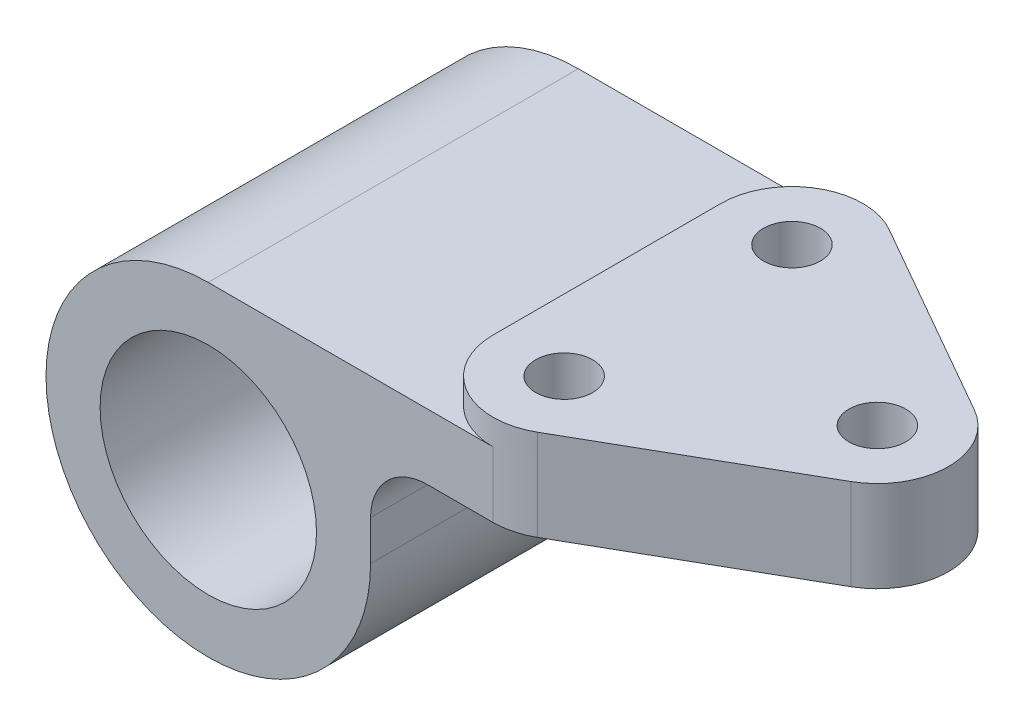
ISO-10303-21;
HEADER;
FILE_DESCRIPTION(('STEP AP214'),'2;1');
FILE_NAME('part.step','',(''),(''),'','','');
FILE_SCHEMA(('AUTOMOTIVE_DESIGN { 1 0 10303 214 1 1 1 1 }'));
ENDSEC;
DATA;
#1=APPLICATION_CONTEXT('core data for automotive mechanical design processes');
#2=APPLICATION_PROTOCOL_DEFINITION('international standard','automotive_design',2000,#1);
#3=PRODUCT_CONTEXT('',#1,'mechanical');
#4=PRODUCT('Part','Part','',(#3));
#5=PRODUCT_RELATED_PRODUCT_CATEGORY('part','',(#4));
#6=PRODUCT_DEFINITION_FORMATION('','',#4);
#7=PRODUCT_DEFINITION_CONTEXT('part definition',#1,'design');
#8=PRODUCT_DEFINITION('design','',#6,#7);
#9=PRODUCT_DEFINITION_SHAPE('','',#8);
#10=(LENGTH_UNIT() NAMED_UNIT(*) SI_UNIT(.MILLI.,.METRE.));
#11=(NAMED_UNIT(*) PLANE_ANGLE_UNIT() SI_UNIT($,.RADIAN.));
#12=(NAMED_UNIT(*) SI_UNIT($,.STERADIAN.) SOLID_ANGLE_UNIT());
#13=UNCERTAINTY_MEASURE_WITH_UNIT(LENGTH_MEASURE(1.E-05),#10,'distance_accuracy_value','');
#14=(GEOMETRIC_REPRESENTATION_CONTEXT(3) GLOBAL_UNCERTAINTY_ASSIGNED_CONTEXT((#13)) GLOBAL_UNIT_ASSIGNED_CONTEXT((#10,
#11,#12)) REPRESENTATION_CONTEXT('',''));
#15=CARTESIAN_POINT('',(0.,0.,0.));
#16=DIRECTION('',(0.,0.,1.));
#17=DIRECTION('',(1.,0.,0.));
#18=AXIS2_PLACEMENT_3D('',#15,#16,#17);
#19=CARTESIAN_POINT('',(0.,33.,32.5));
#20=DIRECTION('',(0.,-1.,0.));
#21=DIRECTION('',(1.,0.,0.));
#22=AXIS2_PLACEMENT_3D('',#19,#20,#21);
#23=PLANE('',#22);
#24=DIRECTION('',(0.,0.,-1.));
#25=VECTOR('',#24,1.);
#26=CARTESIAN_POINT('',(37.5,33.,32.5));
#27=LINE('',#26,#25);
#28=CARTESIAN_POINT('',(37.5,33.,20.));
#29=VERTEX_POINT('',#28);
#30=CARTESIAN_POINT('',(37.5,33.,-20.));
#31=VERTEX_POINT('',#30);
#32=EDGE_CURVE('E264',#29,#31,#27,.T.);
#33=ORIENTED_EDGE('',*,*,#32,.F.);
#34=CARTESIAN_POINT('',(50.,33.,20.));
#35=DIRECTION('',(0.,1.,0.));
#36=DIRECTION('',(-1.,0.,0.));
#37=AXIS2_PLACEMENT_3D('',#34,#35,#36);
#38=CIRCLE('',#37,12.5);
#39=CARTESIAN_POINT('',(56.2017367294604,33.,30.8530392765557));
#40=VERTEX_POINT('',#39);
#41=EDGE_CURVE('E244',#29,#40,#38,.T.);
#42=ORIENTED_EDGE('',*,*,#41,.T.);
#43=DIRECTION('',(0.868243142124459,0.,-0.496138938356834));
#44=VECTOR('',#43,1.);
#45=CARTESIAN_POINT('',(27.1248136525373,33.,47.4684238919404));
#46=LINE('',#45,#44);
#47=CARTESIAN_POINT('',(91.2017367294604,33.,10.8530392765557));
#48=VERTEX_POINT('',#47);
#49=EDGE_CURVE('E374',#40,#48,#46,.T.);
#50=ORIENTED_EDGE('',*,*,#49,.T.);
#51=CARTESIAN_POINT('',(85.,33.,0.));
#52=DIRECTION('',(0.,1.,0.));
#53=DIRECTION('',(-1.,0.,0.));
#54=AXIS2_PLACEMENT_3D('',#51,#52,#53);
#55=CIRCLE('',#54,12.5);
#56=CARTESIAN_POINT('',(91.2017367294604,33.,-10.8530392765557));
#57=VERTEX_POINT('',#56);
#58=EDGE_CURVE('E344',#57,#48,#55,.F.);
#59=ORIENTED_EDGE('',*,*,#58,.F.);
#60=DIRECTION('',(0.868243142124459,0.,0.496138938356834));
#61=VECTOR('',#60,1.);
#62=CARTESIAN_POINT('',(27.1248136525373,33.,-47.4684238919404));
#63=LINE('',#62,#61);
#64=CARTESIAN_POINT('',(56.2017367294604,33.,-30.8530392765557));
#65=VERTEX_POINT('',#64);
#66=EDGE_CURVE('E349',#65,#57,#63,.T.);
#67=ORIENTED_EDGE('',*,*,#66,.F.);
#68=CARTESIAN_POINT('',(50.,33.,-20.));
#69=DIRECTION('',(0.,1.,0.));
#70=DIRECTION('',(-1.,0.,0.));
#71=AXIS2_PLACEMENT_3D('',#68,#69,#70);
#72=CIRCLE('',#71,12.5);
#73=EDGE_CURVE('E357',#31,#65,#72,.F.);
#74=ORIENTED_EDGE('',*,*,#73,.F.);
#75=EDGE_LOOP('',(#33,#42,#50,#59,#67,#74));
#76=FACE_BOUND('',#75,.T.);
#77=CARTESIAN_POINT('',(50.,33.,20.));
#78=DIRECTION('',(0.,1.,0.));
#79=DIRECTION('',(-1.,0.,0.));
#80=AXIS2_PLACEMENT_3D('',#77,#78,#79);
#81=CIRCLE('',#80,5.);
#82=CARTESIAN_POINT('',(45.,33.,20.));
#83=VERTEX_POINT('',#82);
#84=EDGE_CURVE('E250',#83,#83,#81,.T.);
#85=ORIENTED_EDGE('',*,*,#84,.F.);
#86=EDGE_LOOP('',(#85));
#87=FACE_BOUND('',#86,.T.);
#88=CARTESIAN_POINT('',(50.,33.,-20.));
#89=DIRECTION('',(0.,1.,0.));
#90=DIRECTION('',(-1.,0.,0.));
#91=AXIS2_PLACEMENT_3D('',#88,#89,#90);
#92=CIRCLE('',#91,5.);
#93=CARTESIAN_POINT('',(45.,33.,-20.));
#94=VERTEX_POINT('',#93);
#95=EDGE_CURVE('E406',#94,#94,#92,.T.);
#96=ORIENTED_EDGE('',*,*,#95,.F.);
#97=EDGE_LOOP('',(#96));
#98=FACE_BOUND('',#97,.T.);
#99=CARTESIAN_POINT('',(85.,33.,0.));
#100=DIRECTION('',(0.,1.,0.));
#101=DIRECTION('',(-1.,0.,0.));
#102=AXIS2_PLACEMENT_3D('',#99,#100,#101);
#103=CIRCLE('',#102,5.);
#104=CARTESIAN_POINT('',(80.,33.,0.));
#105=VERTEX_POINT('',#104);
#106=EDGE_CURVE('E397',#105,#105,#103,.T.);
#107=ORIENTED_EDGE('',*,*,#106,.F.);
#108=EDGE_LOOP('',(#107));
#109=FACE_BOUND('',#108,.T.);
#110=ADVANCED_FACE('F148',(#76,#87,#98,#109),#23,.F.);
#111=CARTESIAN_POINT('',(0.,0.,32.5));
#112=DIRECTION('',(0.,0.,1.));
#113=DIRECTION('',(1.,0.,0.));
#114=AXIS2_PLACEMENT_3D('',#111,#112,#113);
#115=PLANE('',#114);
#116=CARTESIAN_POINT('',(0.,0.,32.5));
#117=DIRECTION('',(0.,0.,1.));
#118=DIRECTION('',(1.,0.,0.));
#119=AXIS2_PLACEMENT_3D('',#116,#117,#118);
#120=CIRCLE('',#119,19.);
#121=CARTESIAN_POINT('',(19.,0.,32.5));
#122=VERTEX_POINT('',#121);
#123=EDGE_CURVE('E304',#122,#122,#120,.T.);
#124=ORIENTED_EDGE('',*,*,#123,.F.);
#125=EDGE_LOOP('',(#124));
#126=FACE_BOUND('',#125,.T.);
#127=DIRECTION('',(0.,1.,0.));
#128=VECTOR('',#127,1.);
#129=CARTESIAN_POINT('',(50.,-28.501,32.5));
#130=LINE('',#129,#128);
#131=CARTESIAN_POINT('',(50.,17.,32.5));
#132=VERTEX_POINT('',#131);
#133=CARTESIAN_POINT('',(50.,28.5,32.5));
#134=VERTEX_POINT('',#133);
#135=EDGE_CURVE('E370',#132,#134,#130,.T.);
#136=ORIENTED_EDGE('',*,*,#135,.T.);
#137=DIRECTION('',(1.,0.,0.));
#138=VECTOR('',#137,1.);
#139=CARTESIAN_POINT('',(0.,28.5,32.5));
#140=LINE('',#139,#138);
#141=CARTESIAN_POINT('',(0.,28.5,32.5));
#142=VERTEX_POINT('',#141);
#143=EDGE_CURVE('E164',#142,#134,#140,.T.);
#144=ORIENTED_EDGE('',*,*,#143,.F.);
#145=CARTESIAN_POINT('',(0.,0.,32.5));
#146=DIRECTION('',(0.,0.,1.));
#147=DIRECTION('',(1.,0.,0.));
#148=AXIS2_PLACEMENT_3D('',#145,#146,#147);
#149=CIRCLE('',#148,28.5);
#150=CARTESIAN_POINT('',(28.5,0.,32.5));
#151=VERTEX_POINT('',#150);
#152=EDGE_CURVE('E307',#142,#151,#149,.T.);
#153=ORIENTED_EDGE('',*,*,#152,.T.);
#154=DIRECTION('',(0.,1.,0.));
#155=VECTOR('',#154,1.);
#156=CARTESIAN_POINT('',(28.5,0.,32.5));
#157=LINE('',#156,#155);
#158=CARTESIAN_POINT('',(28.5,7.00000000000003,32.5));
#159=VERTEX_POINT('',#158);
#160=EDGE_CURVE('E313',#151,#159,#157,.T.);
#161=ORIENTED_EDGE('',*,*,#160,.T.);
#162=CARTESIAN_POINT('',(38.5,7.00000000000003,32.5));
#163=DIRECTION('',(0.,0.,1.));
#164=DIRECTION('',(1.,0.,0.));
#165=AXIS2_PLACEMENT_3D('',#162,#163,#164);
#166=CIRCLE('',#165,10.);
#167=CARTESIAN_POINT('',(38.5,17.,32.5));
#168=VERTEX_POINT('',#167);
#169=EDGE_CURVE('E285',#159,#168,#166,.F.);
#170=ORIENTED_EDGE('',*,*,#169,.T.);
#171=DIRECTION('',(1.,0.,0.));
#172=VECTOR('',#171,1.);
#173=CARTESIAN_POINT('',(0.,17.,32.5));
#174=LINE('',#173,#172);
#175=EDGE_CURVE('E322',#168,#132,#174,.T.);
#176=ORIENTED_EDGE('',*,*,#175,.T.);
#177=EDGE_LOOP('',(#136,#144,#153,#161,#170,#176));
#178=FACE_BOUND('',#177,.T.);
#179=ADVANCED_FACE('F430',(#126,#178),#115,.T.);
#180=CARTESIAN_POINT('',(0.,0.,-32.5));
#181=DIRECTION('',(0.,0.,1.));
#182=DIRECTION('',(1.,0.,0.));
#183=AXIS2_PLACEMENT_3D('',#180,#181,#182);
#184=PLANE('',#183);
#185=CARTESIAN_POINT('',(0.,0.,-32.5));
#186=DIRECTION('',(0.,0.,1.));
#187=DIRECTION('',(1.,0.,0.));
#188=AXIS2_PLACEMENT_3D('',#185,#186,#187);
#189=CIRCLE('',#188,19.);
#190=CARTESIAN_POINT('',(19.,0.,-32.5));
#191=VERTEX_POINT('',#190);
#192=EDGE_CURVE('E328',#191,#191,#189,.T.);
#193=ORIENTED_EDGE('',*,*,#192,.T.);
#194=EDGE_LOOP('',(#193));
#195=FACE_BOUND('',#194,.T.);
#196=DIRECTION('',(1.,0.,0.));
#197=VECTOR('',#196,1.);
#198=CARTESIAN_POINT('',(0.,28.5,-32.5));
#199=LINE('',#198,#197);
#200=CARTESIAN_POINT('',(0.,28.5,-32.5));
#201=VERTEX_POINT('',#200);
#202=CARTESIAN_POINT('',(50.,28.5,-32.5));
#203=VERTEX_POINT('',#202);
#204=EDGE_CURVE('E298',#201,#203,#199,.T.);
#205=ORIENTED_EDGE('',*,*,#204,.T.);
#206=DIRECTION('',(0.,1.,0.));
#207=VECTOR('',#206,1.);
#208=CARTESIAN_POINT('',(50.,-28.501,-32.5));
#209=LINE('',#208,#207);
#210=CARTESIAN_POINT('',(50.,17.,-32.5));
#211=VERTEX_POINT('',#210);
#212=EDGE_CURVE('E340',#211,#203,#209,.T.);
#213=ORIENTED_EDGE('',*,*,#212,.F.);
#214=DIRECTION('',(1.,0.,0.));
#215=VECTOR('',#214,1.);
#216=CARTESIAN_POINT('',(0.,17.,-32.5));
#217=LINE('',#216,#215);
#218=CARTESIAN_POINT('',(38.5,17.,-32.5));
#219=VERTEX_POINT('',#218);
#220=EDGE_CURVE('E293',#219,#211,#217,.T.);
#221=ORIENTED_EDGE('',*,*,#220,.F.);
#222=CARTESIAN_POINT('',(38.5,7.00000000000003,-32.5));
#223=DIRECTION('',(0.,0.,1.));
#224=DIRECTION('',(1.,0.,0.));
#225=AXIS2_PLACEMENT_3D('',#222,#223,#224);
#226=CIRCLE('',#225,10.);
#227=CARTESIAN_POINT('',(28.5,7.00000000000003,-32.5));
#228=VERTEX_POINT('',#227);
#229=EDGE_CURVE('E284',#228,#219,#226,.F.);
#230=ORIENTED_EDGE('',*,*,#229,.F.);
#231=DIRECTION('',(0.,1.,0.));
#232=VECTOR('',#231,1.);
#233=CARTESIAN_POINT('',(28.5,0.,-32.5));
#234=LINE('',#233,#232);
#235=CARTESIAN_POINT('',(28.5,0.,-32.5));
#236=VERTEX_POINT('',#235);
#237=EDGE_CURVE('E291',#236,#228,#234,.T.);
#238=ORIENTED_EDGE('',*,*,#237,.F.);
#239=CARTESIAN_POINT('',(0.,0.,-32.5));
#240=DIRECTION('',(0.,0.,1.));
#241=DIRECTION('',(1.,0.,0.));
#242=AXIS2_PLACEMENT_3D('',#239,#240,#241);
#243=CIRCLE('',#242,28.5);
#244=EDGE_CURVE('E300',#201,#236,#243,.T.);
#245=ORIENTED_EDGE('',*,*,#244,.F.);
#246=EDGE_LOOP('',(#205,#213,#221,#230,#238,#245));
#247=FACE_BOUND('',#246,.T.);
#248=ADVANCED_FACE('F289',(#195,#247),#184,.F.);
#249=CARTESIAN_POINT('',(0.,17.,32.5));
#250=DIRECTION('',(0.,1.,0.));
#251=DIRECTION('',(-1.,0.,0.));
#252=AXIS2_PLACEMENT_3D('',#249,#250,#251);
#253=PLANE('',#252);
#254=CARTESIAN_POINT('',(50.,17.,20.));
#255=DIRECTION('',(0.,1.,0.));
#256=DIRECTION('',(-1.,0.,0.));
#257=AXIS2_PLACEMENT_3D('',#254,#255,#256);
#258=CIRCLE('',#257,5.);
#259=CARTESIAN_POINT('',(45.,17.,20.));
#260=VERTEX_POINT('',#259);
#261=EDGE_CURVE('E402',#260,#260,#258,.F.);
#262=ORIENTED_EDGE('',*,*,#261,.F.);
#263=EDGE_LOOP('',(#262));
#264=FACE_BOUND('',#263,.T.);
#265=CARTESIAN_POINT('',(50.,17.,-20.));
#266=DIRECTION('',(0.,1.,0.));
#267=DIRECTION('',(-1.,0.,0.));
#268=AXIS2_PLACEMENT_3D('',#265,#266,#267);
#269=CIRCLE('',#268,5.);
#270=CARTESIAN_POINT('',(45.,17.,-20.));
#271=VERTEX_POINT('',#270);
#272=EDGE_CURVE('E401',#271,#271,#269,.F.);
#273=ORIENTED_EDGE('',*,*,#272,.F.);
#274=EDGE_LOOP('',(#273));
#275=FACE_BOUND('',#274,.T.);
#276=CARTESIAN_POINT('',(85.,17.,0.));
#277=DIRECTION('',(0.,1.,0.));
#278=DIRECTION('',(-1.,0.,0.));
#279=AXIS2_PLACEMENT_3D('',#276,#277,#278);
#280=CIRCLE('',#279,5.);
#281=CARTESIAN_POINT('',(80.,17.,0.));
#282=VERTEX_POINT('',#281);
#283=EDGE_CURVE('E393',#282,#282,#280,.F.);
#284=ORIENTED_EDGE('',*,*,#283,.F.);
#285=EDGE_LOOP('',(#284));
#286=FACE_BOUND('',#285,.T.);
#287=CARTESIAN_POINT('',(50.,17.,20.));
#288=DIRECTION('',(0.,1.,0.));
#289=DIRECTION('',(-1.,0.,0.));
#290=AXIS2_PLACEMENT_3D('',#287,#288,#289);
#291=CIRCLE('',#290,12.5);
#292=CARTESIAN_POINT('',(56.2017367294604,17.,30.8530392765557));
#293=VERTEX_POINT('',#292);
#294=EDGE_CURVE('E385',#293,#132,#291,.F.);
#295=ORIENTED_EDGE('',*,*,#294,.T.);
#296=ORIENTED_EDGE('',*,*,#175,.F.);
#297=DIRECTION('',(0.,0.,-1.));
#298=VECTOR('',#297,1.);
#299=CARTESIAN_POINT('',(38.5,17.,32.5));
#300=LINE('',#299,#298);
#301=EDGE_CURVE('E269',#168,#219,#300,.T.);
#302=ORIENTED_EDGE('',*,*,#301,.T.);
#303=ORIENTED_EDGE('',*,*,#220,.T.);
#304=CARTESIAN_POINT('',(50.,17.,-20.));
#305=DIRECTION('',(0.,1.,0.));
#306=DIRECTION('',(-1.,0.,0.));
#307=AXIS2_PLACEMENT_3D('',#304,#305,#306);
#308=CIRCLE('',#307,12.5);
#309=CARTESIAN_POINT('',(56.2017367294604,17.,-30.8530392765557));
#310=VERTEX_POINT('',#309);
#311=EDGE_CURVE('E172',#310,#211,#308,.T.);
#312=ORIENTED_EDGE('',*,*,#311,.F.);
#313=DIRECTION('',(-0.868243142124459,0.,-0.496138938356834));
#314=VECTOR('',#313,1.);
#315=CARTESIAN_POINT('',(27.1248136525373,17.,-47.4684238919404));
#316=LINE('',#315,#314);
#317=CARTESIAN_POINT('',(91.2017367294604,17.,-10.8530392765557));
#318=VERTEX_POINT('',#317);
#319=EDGE_CURVE('E365',#318,#310,#316,.T.);
#320=ORIENTED_EDGE('',*,*,#319,.F.);
#321=CARTESIAN_POINT('',(85.,17.,0.));
#322=DIRECTION('',(0.,1.,0.));
#323=DIRECTION('',(-1.,0.,0.));
#324=AXIS2_PLACEMENT_3D('',#321,#322,#323);
#325=CIRCLE('',#324,12.5);
#326=CARTESIAN_POINT('',(91.2017367294604,17.,10.8530392765557));
#327=VERTEX_POINT('',#326);
#328=EDGE_CURVE('E361',#327,#318,#325,.T.);
#329=ORIENTED_EDGE('',*,*,#328,.F.);
#330=DIRECTION('',(-0.868243142124459,0.,0.496138938356834));
#331=VECTOR('',#330,1.);
#332=CARTESIAN_POINT('',(27.1248136525373,17.,47.4684238919404));
#333=LINE('',#332,#331);
#334=EDGE_CURVE('E389',#327,#293,#333,.T.);
#335=ORIENTED_EDGE('',*,*,#334,.T.);
#336=EDGE_LOOP('',(#295,#296,#302,#303,#312,#320,#329,#335));
#337=FACE_BOUND('',#336,.T.);
#338=ADVANCED_FACE('F425',(#264,#275,#286,#337),#253,.F.);
#339=CARTESIAN_POINT('',(0.,0.,32.5));
#340=DIRECTION('',(0.,0.,-1.));
#341=DIRECTION('',(-1.,0.,0.));
#342=AXIS2_PLACEMENT_3D('',#339,#340,#341);
#343=CYLINDRICAL_SURFACE('',#342,28.5);
#344=ORIENTED_EDGE('',*,*,#244,.T.);
#345=DIRECTION('',(0.,0.,-1.));
#346=VECTOR('',#345,1.);
#347=CARTESIAN_POINT('',(28.5,0.,32.5));
#348=LINE('',#347,#346);
#349=EDGE_CURVE('E12',#151,#236,#348,.T.);
#350=ORIENTED_EDGE('',*,*,#349,.F.);
#351=ORIENTED_EDGE('',*,*,#152,.F.);
#352=DIRECTION('',(0.,0.,-1.));
#353=VECTOR('',#352,1.);
#354=CARTESIAN_POINT('',(0.,28.5,32.5));
#355=LINE('',#354,#353);
#356=EDGE_CURVE('E265',#142,#201,#355,.T.);
#357=ORIENTED_EDGE('',*,*,#356,.T.);
#358=EDGE_LOOP('',(#344,#350,#351,#357));
#359=FACE_BOUND('',#358,.T.);
#360=ADVANCED_FACE('F335',(#359),#343,.T.);
#361=CARTESIAN_POINT('',(28.5,0.,32.5));
#362=DIRECTION('',(-1.,0.,0.));
#363=DIRECTION('',(0.,0.,1.));
#364=AXIS2_PLACEMENT_3D('',#361,#362,#363);
#365=PLANE('',#364);
#366=ORIENTED_EDGE('',*,*,#237,.T.);
#367=DIRECTION('',(0.,0.,-1.));
#368=VECTOR('',#367,1.);
#369=CARTESIAN_POINT('',(28.5,7.00000000000003,32.5));
#370=LINE('',#369,#368);
#371=EDGE_CURVE('E157',#159,#228,#370,.T.);
#372=ORIENTED_EDGE('',*,*,#371,.F.);
#373=ORIENTED_EDGE('',*,*,#160,.F.);
#374=ORIENTED_EDGE('',*,*,#349,.T.);
#375=EDGE_LOOP('',(#366,#372,#373,#374));
#376=FACE_BOUND('',#375,.T.);
#377=ADVANCED_FACE('F431',(#376),#365,.F.);
#378=CARTESIAN_POINT('',(38.5,7.00000000000003,32.5));
#379=DIRECTION('',(0.,0.,-1.));
#380=DIRECTION('',(-1.,0.,0.));
#381=AXIS2_PLACEMENT_3D('',#378,#379,#380);
#382=CYLINDRICAL_SURFACE('',#381,10.);
#383=ORIENTED_EDGE('',*,*,#229,.T.);
#384=ORIENTED_EDGE('',*,*,#301,.F.);
#385=ORIENTED_EDGE('',*,*,#169,.F.);
#386=ORIENTED_EDGE('',*,*,#371,.T.);
#387=EDGE_LOOP('',(#383,#384,#385,#386));
#388=FACE_BOUND('',#387,.T.);
#389=ADVANCED_FACE('F282',(#388),#382,.F.);
#390=CARTESIAN_POINT('',(37.5,0.,32.5));
#391=DIRECTION('',(1.,0.,0.));
#392=DIRECTION('',(0.,0.,-1.));
#393=AXIS2_PLACEMENT_3D('',#390,#391,#392);
#394=PLANE('',#393);
#395=DIRECTION('',(0.,0.,-1.));
#396=VECTOR('',#395,1.);
#397=CARTESIAN_POINT('',(37.5,28.5,32.5));
#398=LINE('',#397,#396);
#399=CARTESIAN_POINT('',(37.5,28.5,20.));
#400=VERTEX_POINT('',#399);
#401=CARTESIAN_POINT('',(37.5,28.5,-20.));
#402=VERTEX_POINT('',#401);
#403=EDGE_CURVE('E256',#400,#402,#398,.T.);
#404=ORIENTED_EDGE('',*,*,#403,.F.);
#405=DIRECTION('',(0.,1.,0.));
#406=VECTOR('',#405,1.);
#407=CARTESIAN_POINT('',(37.5,28.5,20.));
#408=LINE('',#407,#406);
#409=EDGE_CURVE('E239',#400,#29,#408,.T.);
#410=ORIENTED_EDGE('',*,*,#409,.T.);
#411=ORIENTED_EDGE('',*,*,#32,.T.);
#412=DIRECTION('',(0.,1.,0.));
#413=VECTOR('',#412,1.);
#414=CARTESIAN_POINT('',(37.5,28.5,-20.));
#415=LINE('',#414,#413);
#416=EDGE_CURVE('E258',#402,#31,#415,.T.);
#417=ORIENTED_EDGE('',*,*,#416,.F.);
#418=EDGE_LOOP('',(#404,#410,#411,#417));
#419=FACE_BOUND('',#418,.T.);
#420=ADVANCED_FACE('F261',(#419),#394,.F.);
#421=CARTESIAN_POINT('',(0.,0.,32.5));
#422=DIRECTION('',(0.,0.,-1.));
#423=DIRECTION('',(-1.,0.,0.));
#424=AXIS2_PLACEMENT_3D('',#421,#422,#423);
#425=CYLINDRICAL_SURFACE('',#424,19.);
#426=ORIENTED_EDGE('',*,*,#123,.T.);
#427=EDGE_LOOP('',(#426));
#428=FACE_BOUND('',#427,.T.);
#429=ORIENTED_EDGE('',*,*,#192,.F.);
#430=EDGE_LOOP('',(#429));
#431=FACE_BOUND('',#430,.T.);
#432=ADVANCED_FACE('F150',(#428,#431),#425,.F.);
#433=CARTESIAN_POINT('',(0.,28.5,32.5));
#434=DIRECTION('',(0.,1.,0.));
#435=DIRECTION('',(0.,0.,1.));
#436=AXIS2_PLACEMENT_3D('',#433,#434,#435);
#437=PLANE('',#436);
#438=ORIENTED_EDGE('',*,*,#204,.F.);
#439=ORIENTED_EDGE('',*,*,#356,.F.);
#440=ORIENTED_EDGE('',*,*,#143,.T.);
#441=CARTESIAN_POINT('',(50.,28.5,20.));
#442=DIRECTION('',(0.,1.,0.));
#443=DIRECTION('',(-1.,0.,0.));
#444=AXIS2_PLACEMENT_3D('',#441,#442,#443);
#445=CIRCLE('',#444,12.5);
#446=EDGE_CURVE('E241',#400,#134,#445,.T.);
#447=ORIENTED_EDGE('',*,*,#446,.F.);
#448=ORIENTED_EDGE('',*,*,#403,.T.);
#449=CARTESIAN_POINT('',(50.,28.5,-20.));
#450=DIRECTION('',(0.,1.,0.));
#451=DIRECTION('',(-1.,0.,0.));
#452=AXIS2_PLACEMENT_3D('',#449,#450,#451);
#453=CIRCLE('',#452,12.5);
#454=EDGE_CURVE('E337',#402,#203,#453,.F.);
#455=ORIENTED_EDGE('',*,*,#454,.T.);
#456=EDGE_LOOP('',(#438,#439,#440,#447,#448,#455));
#457=FACE_BOUND('',#456,.T.);
#458=ADVANCED_FACE('F254',(#457),#437,.T.);
#459=CARTESIAN_POINT('',(85.,-28.501,0.));
#460=DIRECTION('',(0.,1.,0.));
#461=DIRECTION('',(-1.,0.,0.));
#462=AXIS2_PLACEMENT_3D('',#459,#460,#461);
#463=CYLINDRICAL_SURFACE('',#462,12.5);
#464=ORIENTED_EDGE('',*,*,#328,.T.);
#465=DIRECTION('',(0.,1.,0.));
#466=VECTOR('',#465,1.);
#467=CARTESIAN_POINT('',(91.2017367294604,-28.501,-10.8530392765557));
#468=LINE('',#467,#466);
#469=EDGE_CURVE('E347',#318,#57,#468,.T.);
#470=ORIENTED_EDGE('',*,*,#469,.T.);
#471=ORIENTED_EDGE('',*,*,#58,.T.);
#472=DIRECTION('',(0.,1.,0.));
#473=VECTOR('',#472,1.);
#474=CARTESIAN_POINT('',(91.2017367294604,-28.501,10.8530392765557));
#475=LINE('',#474,#473);
#476=EDGE_CURVE('E373',#327,#48,#475,.T.);
#477=ORIENTED_EDGE('',*,*,#476,.F.);
#478=EDGE_LOOP('',(#464,#470,#471,#477));
#479=FACE_BOUND('',#478,.T.);
#480=ADVANCED_FACE('F484',(#479),#463,.T.);
#481=CARTESIAN_POINT('',(27.1248136525373,-28.501,-47.4684238919404));
#482=DIRECTION('',(-0.496138938356834,0.,0.868243142124459));
#483=DIRECTION('',(0.868243142124459,0.,0.496138938356834));
#484=AXIS2_PLACEMENT_3D('',#481,#482,#483);
#485=PLANE('',#484);
#486=ORIENTED_EDGE('',*,*,#319,.T.);
#487=DIRECTION('',(0.,1.,0.));
#488=VECTOR('',#487,1.);
#489=CARTESIAN_POINT('',(56.2017367294604,-28.501,-30.8530392765557));
#490=LINE('',#489,#488);
#491=EDGE_CURVE('E343',#310,#65,#490,.T.);
#492=ORIENTED_EDGE('',*,*,#491,.T.);
#493=ORIENTED_EDGE('',*,*,#66,.T.);
#494=ORIENTED_EDGE('',*,*,#469,.F.);
#495=EDGE_LOOP('',(#486,#492,#493,#494));
#496=FACE_BOUND('',#495,.T.);
#497=ADVANCED_FACE('F422',(#496),#485,.F.);
#498=CARTESIAN_POINT('',(50.,-28.501,-20.));
#499=DIRECTION('',(0.,1.,0.));
#500=DIRECTION('',(-1.,0.,0.));
#501=AXIS2_PLACEMENT_3D('',#498,#499,#500);
#502=CYLINDRICAL_SURFACE('',#501,12.5);
#503=ORIENTED_EDGE('',*,*,#311,.T.);
#504=ORIENTED_EDGE('',*,*,#212,.T.);
#505=ORIENTED_EDGE('',*,*,#454,.F.);
#506=ORIENTED_EDGE('',*,*,#416,.T.);
#507=ORIENTED_EDGE('',*,*,#73,.T.);
#508=ORIENTED_EDGE('',*,*,#491,.F.);
#509=EDGE_LOOP('',(#503,#504,#505,#506,#507,#508));
#510=FACE_BOUND('',#509,.T.);
#511=ADVANCED_FACE('F341',(#510),#502,.T.);
#512=CARTESIAN_POINT('',(50.,-28.501,20.));
#513=DIRECTION('',(0.,1.,0.));
#514=DIRECTION('',(-1.,0.,0.));
#515=AXIS2_PLACEMENT_3D('',#512,#513,#514);
#516=CYLINDRICAL_SURFACE('',#515,12.5);
#517=DIRECTION('',(0.,1.,0.));
#518=VECTOR('',#517,1.);
#519=CARTESIAN_POINT('',(56.2017367294604,-28.501,30.8530392765557));
#520=LINE('',#519,#518);
#521=EDGE_CURVE('E369',#293,#40,#520,.T.);
#522=ORIENTED_EDGE('',*,*,#521,.T.);
#523=ORIENTED_EDGE('',*,*,#41,.F.);
#524=ORIENTED_EDGE('',*,*,#409,.F.);
#525=ORIENTED_EDGE('',*,*,#446,.T.);
#526=ORIENTED_EDGE('',*,*,#135,.F.);
#527=ORIENTED_EDGE('',*,*,#294,.F.);
#528=EDGE_LOOP('',(#522,#523,#524,#525,#526,#527));
#529=FACE_BOUND('',#528,.T.);
#530=ADVANCED_FACE('F240',(#529),#516,.T.);
#531=CARTESIAN_POINT('',(27.1248136525373,-28.501,47.4684238919404));
#532=DIRECTION('',(0.496138938356834,0.,0.868243142124459));
#533=DIRECTION('',(0.868243142124459,0.,-0.496138938356834));
#534=AXIS2_PLACEMENT_3D('',#531,#532,#533);
#535=PLANE('',#534);
#536=ORIENTED_EDGE('',*,*,#476,.T.);
#537=ORIENTED_EDGE('',*,*,#49,.F.);
#538=ORIENTED_EDGE('',*,*,#521,.F.);
#539=ORIENTED_EDGE('',*,*,#334,.F.);
#540=EDGE_LOOP('',(#536,#537,#538,#539));
#541=FACE_BOUND('',#540,.T.);
#542=ADVANCED_FACE('F468',(#541),#535,.T.);
#543=CARTESIAN_POINT('',(85.,-28.501,0.));
#544=DIRECTION('',(0.,1.,0.));
#545=DIRECTION('',(-1.,0.,0.));
#546=AXIS2_PLACEMENT_3D('',#543,#544,#545);
#547=CYLINDRICAL_SURFACE('',#546,5.);
#548=ORIENTED_EDGE('',*,*,#106,.T.);
#549=EDGE_LOOP('',(#548));
#550=FACE_BOUND('',#549,.T.);
#551=ORIENTED_EDGE('',*,*,#283,.T.);
#552=EDGE_LOOP('',(#551));
#553=FACE_BOUND('',#552,.T.);
#554=ADVANCED_FACE('F465',(#550,#553),#547,.F.);
#555=CARTESIAN_POINT('',(50.,-28.501,-20.));
#556=DIRECTION('',(0.,1.,0.));
#557=DIRECTION('',(-1.,0.,0.));
#558=AXIS2_PLACEMENT_3D('',#555,#556,#557);
#559=CYLINDRICAL_SURFACE('',#558,5.);
#560=ORIENTED_EDGE('',*,*,#95,.T.);
#561=EDGE_LOOP('',(#560));
#562=FACE_BOUND('',#561,.T.);
#563=ORIENTED_EDGE('',*,*,#272,.T.);
#564=EDGE_LOOP('',(#563));
#565=FACE_BOUND('',#564,.T.);
#566=ADVANCED_FACE('F467',(#562,#565),#559,.F.);
#567=CARTESIAN_POINT('',(50.,-28.501,20.));
#568=DIRECTION('',(0.,1.,0.));
#569=DIRECTION('',(-1.,0.,0.));
#570=AXIS2_PLACEMENT_3D('',#567,#568,#569);
#571=CYLINDRICAL_SURFACE('',#570,5.);
#572=ORIENTED_EDGE('',*,*,#84,.T.);
#573=EDGE_LOOP('',(#572));
#574=FACE_BOUND('',#573,.T.);
#575=ORIENTED_EDGE('',*,*,#261,.T.);
#576=EDGE_LOOP('',(#575));
#577=FACE_BOUND('',#576,.T.);
#578=ADVANCED_FACE('F475',(#574,#577),#571,.F.);
#579=CLOSED_SHELL('',(#110,#179,#248,#338,#360,#377,#389,#420,#432,#458,#480,#497,#511,#530,
#542,#554,#566,#578));
#580=MANIFOLD_SOLID_BREP('B2',#579);
#581=ADVANCED_BREP_SHAPE_REPRESENTATION('',(#18,#580),#14);
#582=SHAPE_DEFINITION_REPRESENTATION(#9,#581);
ENDSEC;
END-ISO-10303-21;
